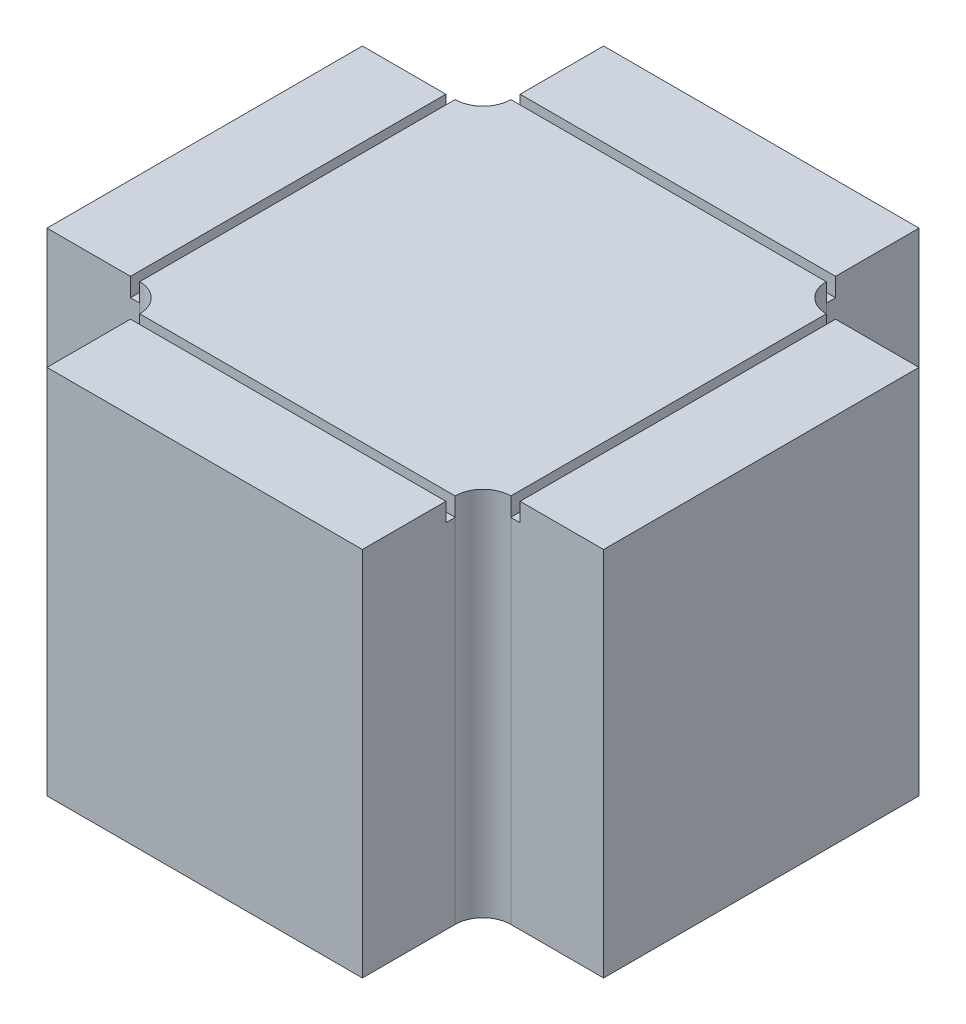
ISO-10303-21;
HEADER;
FILE_DESCRIPTION(('STEP AP214'),'2;1');
FILE_NAME('part.step','',(''),(''),'','','');
FILE_SCHEMA(('AUTOMOTIVE_DESIGN { 1 0 10303 214 1 1 1 1 }'));
ENDSEC;
DATA;
#1=APPLICATION_CONTEXT('core data for automotive mechanical design processes');
#2=APPLICATION_PROTOCOL_DEFINITION('international standard','automotive_design',2000,#1);
#3=PRODUCT_CONTEXT('',#1,'mechanical');
#4=PRODUCT('Part','Part','',(#3));
#5=PRODUCT_RELATED_PRODUCT_CATEGORY('part','',(#4));
#6=PRODUCT_DEFINITION_FORMATION('','',#4);
#7=PRODUCT_DEFINITION_CONTEXT('part definition',#1,'design');
#8=PRODUCT_DEFINITION('design','',#6,#7);
#9=PRODUCT_DEFINITION_SHAPE('','',#8);
#10=(LENGTH_UNIT() NAMED_UNIT(*) SI_UNIT(.MILLI.,.METRE.));
#11=(NAMED_UNIT(*) PLANE_ANGLE_UNIT() SI_UNIT($,.RADIAN.));
#12=(NAMED_UNIT(*) SI_UNIT($,.STERADIAN.) SOLID_ANGLE_UNIT());
#13=UNCERTAINTY_MEASURE_WITH_UNIT(LENGTH_MEASURE(1.E-05),#10,'distance_accuracy_value','');
#14=(GEOMETRIC_REPRESENTATION_CONTEXT(3) GLOBAL_UNCERTAINTY_ASSIGNED_CONTEXT((#13)) GLOBAL_UNIT_ASSIGNED_CONTEXT((#10,
#11,#12)) REPRESENTATION_CONTEXT('',''));
#15=CARTESIAN_POINT('',(0.,0.,0.));
#16=DIRECTION('',(0.,0.,1.));
#17=DIRECTION('',(1.,0.,0.));
#18=AXIS2_PLACEMENT_3D('',#15,#16,#17);
#19=CARTESIAN_POINT('',(16.9999999999999,40.,0.));
#20=DIRECTION('',(-1.,0.,0.));
#21=DIRECTION('',(0.,0.,1.));
#22=AXIS2_PLACEMENT_3D('',#19,#20,#21);
#23=PLANE('',#22);
#24=DIRECTION('',(0.,1.,0.));
#25=VECTOR('',#24,1.);
#26=CARTESIAN_POINT('',(16.9999999999999,40.,-21.));
#27=LINE('',#26,#25);
#28=CARTESIAN_POINT('',(16.9999999999999,38.,-21.));
#29=VERTEX_POINT('',#28);
#30=CARTESIAN_POINT('',(16.9999999999999,40.,-21.));
#31=VERTEX_POINT('',#30);
#32=EDGE_CURVE('E470',#29,#31,#27,.T.);
#33=ORIENTED_EDGE('',*,*,#32,.F.);
#34=DIRECTION('',(0.,0.,-1.));
#35=VECTOR('',#34,1.);
#36=CARTESIAN_POINT('',(16.9999999999999,38.,0.));
#37=LINE('',#36,#35);
#38=CARTESIAN_POINT('',(16.9999999999999,38.,-20.));
#39=VERTEX_POINT('',#38);
#40=EDGE_CURVE('E352',#39,#29,#37,.T.);
#41=ORIENTED_EDGE('',*,*,#40,.F.);
#42=DIRECTION('',(0.,-1.,0.));
#43=VECTOR('',#42,1.);
#44=CARTESIAN_POINT('',(16.9999999999999,40.,-20.));
#45=LINE('',#44,#43);
#46=CARTESIAN_POINT('',(16.9999999999999,0.,-20.));
#47=VERTEX_POINT('',#46);
#48=EDGE_CURVE('E282',#39,#47,#45,.T.);
#49=ORIENTED_EDGE('',*,*,#48,.T.);
#50=DIRECTION('',(0.,0.,-1.));
#51=VECTOR('',#50,1.);
#52=CARTESIAN_POINT('',(16.9999999999999,0.,0.));
#53=LINE('',#52,#51);
#54=CARTESIAN_POINT('',(16.9999999999999,0.,-30.));
#55=VERTEX_POINT('',#54);
#56=EDGE_CURVE('E226',#47,#55,#53,.T.);
#57=ORIENTED_EDGE('',*,*,#56,.T.);
#58=DIRECTION('',(0.,-1.,0.));
#59=VECTOR('',#58,1.);
#60=CARTESIAN_POINT('',(16.9999999999999,40.,-30.));
#61=LINE('',#60,#59);
#62=CARTESIAN_POINT('',(16.9999999999999,40.,-30.));
#63=VERTEX_POINT('',#62);
#64=EDGE_CURVE('E279',#63,#55,#61,.T.);
#65=ORIENTED_EDGE('',*,*,#64,.F.);
#66=DIRECTION('',(0.,0.,-1.));
#67=VECTOR('',#66,1.);
#68=CARTESIAN_POINT('',(16.9999999999999,40.,0.));
#69=LINE('',#68,#67);
#70=EDGE_CURVE('E370',#31,#63,#69,.T.);
#71=ORIENTED_EDGE('',*,*,#70,.F.);
#72=EDGE_LOOP('',(#33,#41,#49,#57,#65,#71));
#73=FACE_BOUND('',#72,.T.);
#74=ADVANCED_FACE('F66',(#73),#23,.F.);
#75=CARTESIAN_POINT('',(-17.0000000000001,40.,0.));
#76=DIRECTION('',(-1.,0.,0.));
#77=DIRECTION('',(0.,0.,1.));
#78=AXIS2_PLACEMENT_3D('',#75,#76,#77);
#79=PLANE('',#78);
#80=DIRECTION('',(0.,0.,-1.));
#81=VECTOR('',#80,1.);
#82=CARTESIAN_POINT('',(-17.0000000000001,38.,0.));
#83=LINE('',#82,#81);
#84=CARTESIAN_POINT('',(-17.,38.,-20.));
#85=VERTEX_POINT('',#84);
#86=CARTESIAN_POINT('',(-17.0000000000001,38.,-21.));
#87=VERTEX_POINT('',#86);
#88=EDGE_CURVE('E349',#85,#87,#83,.T.);
#89=ORIENTED_EDGE('',*,*,#88,.T.);
#90=DIRECTION('',(0.,1.,0.));
#91=VECTOR('',#90,1.);
#92=CARTESIAN_POINT('',(-17.0000000000001,40.,-21.));
#93=LINE('',#92,#91);
#94=CARTESIAN_POINT('',(-17.0000000000001,40.,-21.));
#95=VERTEX_POINT('',#94);
#96=EDGE_CURVE('E467',#87,#95,#93,.T.);
#97=ORIENTED_EDGE('',*,*,#96,.T.);
#98=DIRECTION('',(0.,0.,-1.));
#99=VECTOR('',#98,1.);
#100=CARTESIAN_POINT('',(-17.0000000000001,40.,0.));
#101=LINE('',#100,#99);
#102=CARTESIAN_POINT('',(-17.0000000000001,40.,-30.));
#103=VERTEX_POINT('',#102);
#104=EDGE_CURVE('E375',#95,#103,#101,.T.);
#105=ORIENTED_EDGE('',*,*,#104,.T.);
#106=DIRECTION('',(0.,-1.,0.));
#107=VECTOR('',#106,1.);
#108=CARTESIAN_POINT('',(-17.0000000000001,40.,-30.));
#109=LINE('',#108,#107);
#110=CARTESIAN_POINT('',(-17.0000000000001,0.,-30.));
#111=VERTEX_POINT('',#110);
#112=EDGE_CURVE('E277',#103,#111,#109,.T.);
#113=ORIENTED_EDGE('',*,*,#112,.T.);
#114=DIRECTION('',(0.,0.,-1.));
#115=VECTOR('',#114,1.);
#116=CARTESIAN_POINT('',(-17.0000000000001,0.,0.));
#117=LINE('',#116,#115);
#118=CARTESIAN_POINT('',(-17.0000000000001,0.,-20.));
#119=VERTEX_POINT('',#118);
#120=EDGE_CURVE('E231',#119,#111,#117,.T.);
#121=ORIENTED_EDGE('',*,*,#120,.F.);
#122=DIRECTION('',(0.,-1.,0.));
#123=VECTOR('',#122,1.);
#124=CARTESIAN_POINT('',(-17.0000000000001,40.,-20.));
#125=LINE('',#124,#123);
#126=EDGE_CURVE('E273',#85,#119,#125,.T.);
#127=ORIENTED_EDGE('',*,*,#126,.F.);
#128=EDGE_LOOP('',(#89,#97,#105,#113,#121,#127));
#129=FACE_BOUND('',#128,.T.);
#130=ADVANCED_FACE('F553',(#129),#79,.T.);
#131=CARTESIAN_POINT('',(0.,40.,-17.));
#132=DIRECTION('',(0.,0.,1.));
#133=DIRECTION('',(1.,0.,0.));
#134=AXIS2_PLACEMENT_3D('',#131,#132,#133);
#135=PLANE('',#134);
#136=DIRECTION('',(0.,1.,0.));
#137=VECTOR('',#136,1.);
#138=CARTESIAN_POINT('',(-21.,40.,-17.));
#139=LINE('',#138,#137);
#140=CARTESIAN_POINT('',(-21.,38.,-17.));
#141=VERTEX_POINT('',#140);
#142=CARTESIAN_POINT('',(-21.,40.,-17.));
#143=VERTEX_POINT('',#142);
#144=EDGE_CURVE('E332',#141,#143,#139,.T.);
#145=ORIENTED_EDGE('',*,*,#144,.F.);
#146=DIRECTION('',(-1.,0.,0.));
#147=VECTOR('',#146,1.);
#148=CARTESIAN_POINT('',(0.,38.,-17.));
#149=LINE('',#148,#147);
#150=CARTESIAN_POINT('',(-20.,38.,-17.));
#151=VERTEX_POINT('',#150);
#152=EDGE_CURVE('E346',#151,#141,#149,.T.);
#153=ORIENTED_EDGE('',*,*,#152,.F.);
#154=DIRECTION('',(0.,-1.,0.));
#155=VECTOR('',#154,1.);
#156=CARTESIAN_POINT('',(-20.,40.,-17.));
#157=LINE('',#156,#155);
#158=CARTESIAN_POINT('',(-20.,0.,-17.));
#159=VERTEX_POINT('',#158);
#160=EDGE_CURVE('E269',#151,#159,#157,.T.);
#161=ORIENTED_EDGE('',*,*,#160,.T.);
#162=DIRECTION('',(-1.,0.,0.));
#163=VECTOR('',#162,1.);
#164=CARTESIAN_POINT('',(0.,0.,-17.));
#165=LINE('',#164,#163);
#166=CARTESIAN_POINT('',(-30.,0.,-17.));
#167=VERTEX_POINT('',#166);
#168=EDGE_CURVE('E237',#159,#167,#165,.T.);
#169=ORIENTED_EDGE('',*,*,#168,.T.);
#170=DIRECTION('',(0.,-1.,0.));
#171=VECTOR('',#170,1.);
#172=CARTESIAN_POINT('',(-30.,40.,-17.));
#173=LINE('',#172,#171);
#174=CARTESIAN_POINT('',(-30.,40.,-17.));
#175=VERTEX_POINT('',#174);
#176=EDGE_CURVE('E266',#175,#167,#173,.T.);
#177=ORIENTED_EDGE('',*,*,#176,.F.);
#178=DIRECTION('',(-1.,0.,0.));
#179=VECTOR('',#178,1.);
#180=CARTESIAN_POINT('',(0.,40.,-17.));
#181=LINE('',#180,#179);
#182=EDGE_CURVE('E380',#143,#175,#181,.T.);
#183=ORIENTED_EDGE('',*,*,#182,.F.);
#184=EDGE_LOOP('',(#145,#153,#161,#169,#177,#183));
#185=FACE_BOUND('',#184,.T.);
#186=ADVANCED_FACE('F575',(#185),#135,.F.);
#187=CARTESIAN_POINT('',(0.,40.,17.));
#188=DIRECTION('',(0.,0.,1.));
#189=DIRECTION('',(1.,0.,0.));
#190=AXIS2_PLACEMENT_3D('',#187,#188,#189);
#191=PLANE('',#190);
#192=DIRECTION('',(-1.,0.,0.));
#193=VECTOR('',#192,1.);
#194=CARTESIAN_POINT('',(0.,38.,17.));
#195=LINE('',#194,#193);
#196=CARTESIAN_POINT('',(-20.,38.,17.));
#197=VERTEX_POINT('',#196);
#198=CARTESIAN_POINT('',(-21.,38.,17.));
#199=VERTEX_POINT('',#198);
#200=EDGE_CURVE('E343',#197,#199,#195,.T.);
#201=ORIENTED_EDGE('',*,*,#200,.T.);
#202=DIRECTION('',(0.,1.,0.));
#203=VECTOR('',#202,1.);
#204=CARTESIAN_POINT('',(-21.,40.,17.));
#205=LINE('',#204,#203);
#206=CARTESIAN_POINT('',(-21.,40.,17.));
#207=VERTEX_POINT('',#206);
#208=EDGE_CURVE('E337',#199,#207,#205,.T.);
#209=ORIENTED_EDGE('',*,*,#208,.T.);
#210=DIRECTION('',(-1.,0.,0.));
#211=VECTOR('',#210,1.);
#212=CARTESIAN_POINT('',(0.,40.,17.));
#213=LINE('',#212,#211);
#214=CARTESIAN_POINT('',(-30.,40.,17.));
#215=VERTEX_POINT('',#214);
#216=EDGE_CURVE('E385',#207,#215,#213,.T.);
#217=ORIENTED_EDGE('',*,*,#216,.T.);
#218=DIRECTION('',(0.,-1.,0.));
#219=VECTOR('',#218,1.);
#220=CARTESIAN_POINT('',(-30.,40.,17.));
#221=LINE('',#220,#219);
#222=CARTESIAN_POINT('',(-30.,0.,17.));
#223=VERTEX_POINT('',#222);
#224=EDGE_CURVE('E264',#215,#223,#221,.T.);
#225=ORIENTED_EDGE('',*,*,#224,.T.);
#226=DIRECTION('',(-1.,0.,0.));
#227=VECTOR('',#226,1.);
#228=CARTESIAN_POINT('',(0.,0.,17.));
#229=LINE('',#228,#227);
#230=CARTESIAN_POINT('',(-20.,0.,17.));
#231=VERTEX_POINT('',#230);
#232=EDGE_CURVE('E242',#231,#223,#229,.T.);
#233=ORIENTED_EDGE('',*,*,#232,.F.);
#234=DIRECTION('',(0.,-1.,0.));
#235=VECTOR('',#234,1.);
#236=CARTESIAN_POINT('',(-20.,40.,17.));
#237=LINE('',#236,#235);
#238=EDGE_CURVE('E260',#197,#231,#237,.T.);
#239=ORIENTED_EDGE('',*,*,#238,.F.);
#240=EDGE_LOOP('',(#201,#209,#217,#225,#233,#239));
#241=FACE_BOUND('',#240,.T.);
#242=ADVANCED_FACE('F474',(#241),#191,.T.);
#243=CARTESIAN_POINT('',(0.,40.,0.));
#244=DIRECTION('',(0.,1.,0.));
#245=DIRECTION('',(0.,0.,1.));
#246=AXIS2_PLACEMENT_3D('',#243,#244,#245);
#247=PLANE('',#246);
#248=ORIENTED_EDGE('',*,*,#216,.F.);
#249=DIRECTION('',(0.,0.,-1.));
#250=VECTOR('',#249,1.);
#251=CARTESIAN_POINT('',(-21.,40.,0.));
#252=LINE('',#251,#250);
#253=EDGE_CURVE('E316',#207,#143,#252,.T.);
#254=ORIENTED_EDGE('',*,*,#253,.T.);
#255=ORIENTED_EDGE('',*,*,#182,.T.);
#256=DIRECTION('',(0.,0.,1.));
#257=VECTOR('',#256,1.);
#258=CARTESIAN_POINT('',(-30.,40.,0.));
#259=LINE('',#258,#257);
#260=EDGE_CURVE('E382',#175,#215,#259,.T.);
#261=ORIENTED_EDGE('',*,*,#260,.T.);
#262=EDGE_LOOP('',(#248,#254,#255,#261));
#263=FACE_BOUND('',#262,.T.);
#264=ADVANCED_FACE('F480',(#263),#247,.T.);
#265=ORIENTED_EDGE('',*,*,#104,.F.);
#266=DIRECTION('',(1.,0.,0.));
#267=VECTOR('',#266,1.);
#268=CARTESIAN_POINT('',(0.,40.,-21.));
#269=LINE('',#268,#267);
#270=EDGE_CURVE('E313',#95,#31,#269,.T.);
#271=ORIENTED_EDGE('',*,*,#270,.T.);
#272=ORIENTED_EDGE('',*,*,#70,.T.);
#273=DIRECTION('',(-1.,0.,0.));
#274=VECTOR('',#273,1.);
#275=CARTESIAN_POINT('',(0.,40.,-30.));
#276=LINE('',#275,#274);
#277=EDGE_CURVE('E372',#63,#103,#276,.T.);
#278=ORIENTED_EDGE('',*,*,#277,.T.);
#279=EDGE_LOOP('',(#265,#271,#272,#278));
#280=FACE_BOUND('',#279,.T.);
#281=ADVANCED_FACE('F548',(#280),#247,.T.);
#282=CARTESIAN_POINT('',(-20.,40.,20.));
#283=DIRECTION('',(0.,1.,0.));
#284=DIRECTION('',(0.,0.,1.));
#285=AXIS2_PLACEMENT_3D('',#282,#283,#284);
#286=CIRCLE('',#285,3.);
#287=CARTESIAN_POINT('',(-17.,40.,20.));
#288=VERTEX_POINT('',#287);
#289=CARTESIAN_POINT('',(-20.,40.,17.));
#290=VERTEX_POINT('',#289);
#291=EDGE_CURVE('E195',#288,#290,#286,.T.);
#292=ORIENTED_EDGE('',*,*,#291,.F.);
#293=DIRECTION('',(1.,0.,0.));
#294=VECTOR('',#293,1.);
#295=CARTESIAN_POINT('',(0.,40.,20.));
#296=LINE('',#295,#294);
#297=CARTESIAN_POINT('',(17.,40.,19.9999999999999));
#298=VERTEX_POINT('',#297);
#299=EDGE_CURVE('E308',#288,#298,#296,.T.);
#300=ORIENTED_EDGE('',*,*,#299,.T.);
#301=CARTESIAN_POINT('',(20.,40.,20.));
#302=DIRECTION('',(0.,1.,0.));
#303=DIRECTION('',(0.,0.,1.));
#304=AXIS2_PLACEMENT_3D('',#301,#302,#303);
#305=CIRCLE('',#304,3.);
#306=CARTESIAN_POINT('',(20.,40.,16.9999999999999));
#307=VERTEX_POINT('',#306);
#308=EDGE_CURVE('E254',#307,#298,#305,.T.);
#309=ORIENTED_EDGE('',*,*,#308,.F.);
#310=DIRECTION('',(0.,0.,-1.));
#311=VECTOR('',#310,1.);
#312=CARTESIAN_POINT('',(20.,40.,0.));
#313=LINE('',#312,#311);
#314=CARTESIAN_POINT('',(19.9999999999999,40.,-17.0000000000001));
#315=VERTEX_POINT('',#314);
#316=EDGE_CURVE('E299',#307,#315,#313,.T.);
#317=ORIENTED_EDGE('',*,*,#316,.T.);
#318=CARTESIAN_POINT('',(20.,40.,-20.));
#319=DIRECTION('',(0.,1.,0.));
#320=DIRECTION('',(0.,0.,1.));
#321=AXIS2_PLACEMENT_3D('',#318,#319,#320);
#322=CIRCLE('',#321,3.);
#323=CARTESIAN_POINT('',(16.9999999999999,40.,-20.));
#324=VERTEX_POINT('',#323);
#325=EDGE_CURVE('E367',#324,#315,#322,.T.);
#326=ORIENTED_EDGE('',*,*,#325,.F.);
#327=DIRECTION('',(1.,0.,0.));
#328=VECTOR('',#327,1.);
#329=CARTESIAN_POINT('',(0.,40.,-20.));
#330=LINE('',#329,#328);
#331=CARTESIAN_POINT('',(-17.0000000000001,40.,-20.));
#332=VERTEX_POINT('',#331);
#333=EDGE_CURVE('E302',#332,#324,#330,.T.);
#334=ORIENTED_EDGE('',*,*,#333,.F.);
#335=CARTESIAN_POINT('',(-20.,40.,-20.));
#336=DIRECTION('',(0.,1.,0.));
#337=DIRECTION('',(0.,0.,1.));
#338=AXIS2_PLACEMENT_3D('',#335,#336,#337);
#339=CIRCLE('',#338,3.);
#340=CARTESIAN_POINT('',(-20.,40.,-17.));
#341=VERTEX_POINT('',#340);
#342=EDGE_CURVE('E377',#341,#332,#339,.T.);
#343=ORIENTED_EDGE('',*,*,#342,.F.);
#344=DIRECTION('',(0.,0.,-1.));
#345=VECTOR('',#344,1.);
#346=CARTESIAN_POINT('',(-20.,40.,0.));
#347=LINE('',#346,#345);
#348=EDGE_CURVE('E305',#290,#341,#347,.T.);
#349=ORIENTED_EDGE('',*,*,#348,.F.);
#350=EDGE_LOOP('',(#292,#300,#309,#317,#326,#334,#343,#349));
#351=FACE_BOUND('',#350,.T.);
#352=ADVANCED_FACE('F397',(#351),#247,.T.);
#353=DIRECTION('',(1.,0.,0.));
#354=VECTOR('',#353,1.);
#355=CARTESIAN_POINT('',(0.,40.,21.));
#356=LINE('',#355,#354);
#357=CARTESIAN_POINT('',(-17.,40.,21.));
#358=VERTEX_POINT('',#357);
#359=CARTESIAN_POINT('',(17.,40.,21.));
#360=VERTEX_POINT('',#359);
#361=EDGE_CURVE('E75',#358,#360,#356,.T.);
#362=ORIENTED_EDGE('',*,*,#361,.F.);
#363=DIRECTION('',(0.,0.,1.));
#364=VECTOR('',#363,1.);
#365=CARTESIAN_POINT('',(-17.,40.,0.));
#366=LINE('',#365,#364);
#367=CARTESIAN_POINT('',(-17.,40.,29.9999999999999));
#368=VERTEX_POINT('',#367);
#369=EDGE_CURVE('E185',#358,#368,#366,.T.);
#370=ORIENTED_EDGE('',*,*,#369,.T.);
#371=DIRECTION('',(1.,0.,0.));
#372=VECTOR('',#371,1.);
#373=CARTESIAN_POINT('',(0.,40.,29.9999999999999));
#374=LINE('',#373,#372);
#375=CARTESIAN_POINT('',(17.,40.,29.9999999999999));
#376=VERTEX_POINT('',#375);
#377=EDGE_CURVE('E190',#368,#376,#374,.T.);
#378=ORIENTED_EDGE('',*,*,#377,.T.);
#379=DIRECTION('',(0.,0.,1.));
#380=VECTOR('',#379,1.);
#381=CARTESIAN_POINT('',(17.,40.,0.));
#382=LINE('',#381,#380);
#383=EDGE_CURVE('E207',#360,#376,#382,.T.);
#384=ORIENTED_EDGE('',*,*,#383,.F.);
#385=EDGE_LOOP('',(#362,#370,#378,#384));
#386=FACE_BOUND('',#385,.T.);
#387=ADVANCED_FACE('F187',(#386),#247,.T.);
#388=CARTESIAN_POINT('',(20.,40.,20.));
#389=DIRECTION('',(0.,-1.,0.));
#390=DIRECTION('',(0.,0.,-1.));
#391=AXIS2_PLACEMENT_3D('',#388,#389,#390);
#392=CYLINDRICAL_SURFACE('',#391,3.);
#393=CARTESIAN_POINT('',(20.,0.,20.));
#394=DIRECTION('',(0.,1.,0.));
#395=DIRECTION('',(0.,0.,1.));
#396=AXIS2_PLACEMENT_3D('',#393,#394,#395);
#397=CIRCLE('',#396,3.);
#398=CARTESIAN_POINT('',(19.9999999999999,0.,16.9999999999999));
#399=VERTEX_POINT('',#398);
#400=CARTESIAN_POINT('',(17.,0.,19.9999999999999));
#401=VERTEX_POINT('',#400);
#402=EDGE_CURVE('E212',#399,#401,#397,.T.);
#403=ORIENTED_EDGE('',*,*,#402,.F.);
#404=DIRECTION('',(0.,-1.,0.));
#405=VECTOR('',#404,1.);
#406=CARTESIAN_POINT('',(19.9999999999999,40.,16.9999999999999));
#407=LINE('',#406,#405);
#408=CARTESIAN_POINT('',(20.,38.,16.9999999999999));
#409=VERTEX_POINT('',#408);
#410=EDGE_CURVE('E295',#409,#399,#407,.T.);
#411=ORIENTED_EDGE('',*,*,#410,.F.);
#412=EDGE_CURVE('E296',#307,#409,#407,.T.);
#413=ORIENTED_EDGE('',*,*,#412,.F.);
#414=ORIENTED_EDGE('',*,*,#308,.T.);
#415=DIRECTION('',(0.,-1.,0.));
#416=VECTOR('',#415,1.);
#417=CARTESIAN_POINT('',(17.,40.,19.9999999999999));
#418=LINE('',#417,#416);
#419=CARTESIAN_POINT('',(17.,38.,20.));
#420=VERTEX_POINT('',#419);
#421=EDGE_CURVE('E83',#298,#420,#418,.T.);
#422=ORIENTED_EDGE('',*,*,#421,.T.);
#423=EDGE_CURVE('E144',#420,#401,#418,.T.);
#424=ORIENTED_EDGE('',*,*,#423,.T.);
#425=EDGE_LOOP('',(#403,#411,#413,#414,#422,#424));
#426=FACE_BOUND('',#425,.T.);
#427=ADVANCED_FACE('F68',(#426),#392,.F.);
#428=CARTESIAN_POINT('',(0.,40.,16.9999999999999));
#429=DIRECTION('',(0.,0.,-1.));
#430=DIRECTION('',(-1.,0.,0.));
#431=AXIS2_PLACEMENT_3D('',#428,#429,#430);
#432=PLANE('',#431);
#433=DIRECTION('',(1.,0.,0.));
#434=VECTOR('',#433,1.);
#435=CARTESIAN_POINT('',(0.,40.,16.9999999999999));
#436=LINE('',#435,#434);
#437=CARTESIAN_POINT('',(21.,40.,16.9999999999999));
#438=VERTEX_POINT('',#437);
#439=CARTESIAN_POINT('',(29.9999999999999,40.,16.9999999999999));
#440=VERTEX_POINT('',#439);
#441=EDGE_CURVE('E153',#438,#440,#436,.T.);
#442=ORIENTED_EDGE('',*,*,#441,.F.);
#443=DIRECTION('',(0.,-1.,0.));
#444=VECTOR('',#443,1.);
#445=CARTESIAN_POINT('',(21.,40.,16.9999999999999));
#446=LINE('',#445,#444);
#447=CARTESIAN_POINT('',(21.,38.,16.9999999999999));
#448=VERTEX_POINT('',#447);
#449=EDGE_CURVE('E464',#438,#448,#446,.T.);
#450=ORIENTED_EDGE('',*,*,#449,.T.);
#451=DIRECTION('',(1.,0.,0.));
#452=VECTOR('',#451,1.);
#453=CARTESIAN_POINT('',(0.,38.,16.9999999999999));
#454=LINE('',#453,#452);
#455=EDGE_CURVE('E215',#409,#448,#454,.T.);
#456=ORIENTED_EDGE('',*,*,#455,.F.);
#457=ORIENTED_EDGE('',*,*,#410,.T.);
#458=DIRECTION('',(1.,0.,0.));
#459=VECTOR('',#458,1.);
#460=CARTESIAN_POINT('',(0.,0.,16.9999999999999));
#461=LINE('',#460,#459);
#462=CARTESIAN_POINT('',(29.9999999999999,0.,16.9999999999999));
#463=VERTEX_POINT('',#462);
#464=EDGE_CURVE('E214',#399,#463,#461,.T.);
#465=ORIENTED_EDGE('',*,*,#464,.T.);
#466=DIRECTION('',(0.,-1.,0.));
#467=VECTOR('',#466,1.);
#468=CARTESIAN_POINT('',(29.9999999999999,40.,16.9999999999999));
#469=LINE('',#468,#467);
#470=EDGE_CURVE('E292',#440,#463,#469,.T.);
#471=ORIENTED_EDGE('',*,*,#470,.F.);
#472=EDGE_LOOP('',(#442,#450,#456,#457,#465,#471));
#473=FACE_BOUND('',#472,.T.);
#474=ADVANCED_FACE('F587',(#473),#432,.F.);
#475=CARTESIAN_POINT('',(29.9999999999999,40.,0.));
#476=DIRECTION('',(-1.,0.,0.));
#477=DIRECTION('',(0.,0.,1.));
#478=AXIS2_PLACEMENT_3D('',#475,#476,#477);
#479=PLANE('',#478);
#480=DIRECTION('',(0.,0.,-1.));
#481=VECTOR('',#480,1.);
#482=CARTESIAN_POINT('',(29.9999999999999,0.,0.));
#483=LINE('',#482,#481);
#484=CARTESIAN_POINT('',(29.9999999999999,0.,-17.0000000000001));
#485=VERTEX_POINT('',#484);
#486=EDGE_CURVE('E217',#463,#485,#483,.T.);
#487=ORIENTED_EDGE('',*,*,#486,.T.);
#488=DIRECTION('',(0.,-1.,0.));
#489=VECTOR('',#488,1.);
#490=CARTESIAN_POINT('',(29.9999999999999,40.,-17.0000000000001));
#491=LINE('',#490,#489);
#492=CARTESIAN_POINT('',(29.9999999999999,40.,-17.0000000000001));
#493=VERTEX_POINT('',#492);
#494=EDGE_CURVE('E290',#493,#485,#491,.T.);
#495=ORIENTED_EDGE('',*,*,#494,.F.);
#496=DIRECTION('',(0.,0.,-1.));
#497=VECTOR('',#496,1.);
#498=CARTESIAN_POINT('',(29.9999999999999,40.,0.));
#499=LINE('',#498,#497);
#500=EDGE_CURVE('E363',#440,#493,#499,.T.);
#501=ORIENTED_EDGE('',*,*,#500,.F.);
#502=ORIENTED_EDGE('',*,*,#470,.T.);
#503=EDGE_LOOP('',(#487,#495,#501,#502));
#504=FACE_BOUND('',#503,.T.);
#505=ADVANCED_FACE('F584',(#504),#479,.F.);
#506=CARTESIAN_POINT('',(0.,40.,-17.0000000000001));
#507=DIRECTION('',(0.,0.,-1.));
#508=DIRECTION('',(-1.,0.,0.));
#509=AXIS2_PLACEMENT_3D('',#506,#507,#508);
#510=PLANE('',#509);
#511=DIRECTION('',(0.,-1.,0.));
#512=VECTOR('',#511,1.);
#513=CARTESIAN_POINT('',(21.,40.,-17.0000000000001));
#514=LINE('',#513,#512);
#515=CARTESIAN_POINT('',(21.,40.,-17.0000000000001));
#516=VERTEX_POINT('',#515);
#517=CARTESIAN_POINT('',(21.,38.,-17.0000000000001));
#518=VERTEX_POINT('',#517);
#519=EDGE_CURVE('E462',#516,#518,#514,.T.);
#520=ORIENTED_EDGE('',*,*,#519,.F.);
#521=DIRECTION('',(1.,0.,0.));
#522=VECTOR('',#521,1.);
#523=CARTESIAN_POINT('',(0.,40.,-17.0000000000001));
#524=LINE('',#523,#522);
#525=EDGE_CURVE('E365',#516,#493,#524,.T.);
#526=ORIENTED_EDGE('',*,*,#525,.T.);
#527=ORIENTED_EDGE('',*,*,#494,.T.);
#528=DIRECTION('',(1.,0.,0.));
#529=VECTOR('',#528,1.);
#530=CARTESIAN_POINT('',(0.,0.,-17.0000000000001));
#531=LINE('',#530,#529);
#532=CARTESIAN_POINT('',(19.9999999999999,0.,-17.0000000000001));
#533=VERTEX_POINT('',#532);
#534=EDGE_CURVE('E220',#533,#485,#531,.T.);
#535=ORIENTED_EDGE('',*,*,#534,.F.);
#536=DIRECTION('',(0.,-1.,0.));
#537=VECTOR('',#536,1.);
#538=CARTESIAN_POINT('',(19.9999999999999,40.,-17.0000000000001));
#539=LINE('',#538,#537);
#540=CARTESIAN_POINT('',(20.,38.,-17.));
#541=VERTEX_POINT('',#540);
#542=EDGE_CURVE('E286',#541,#533,#539,.T.);
#543=ORIENTED_EDGE('',*,*,#542,.F.);
#544=DIRECTION('',(1.,0.,0.));
#545=VECTOR('',#544,1.);
#546=CARTESIAN_POINT('',(0.,38.,-17.0000000000001));
#547=LINE('',#546,#545);
#548=EDGE_CURVE('E355',#541,#518,#547,.T.);
#549=ORIENTED_EDGE('',*,*,#548,.T.);
#550=EDGE_LOOP('',(#520,#526,#527,#535,#543,#549));
#551=FACE_BOUND('',#550,.T.);
#552=ADVANCED_FACE('F581',(#551),#510,.T.);
#553=CARTESIAN_POINT('',(20.,40.,-20.));
#554=DIRECTION('',(0.,-1.,0.));
#555=DIRECTION('',(0.,0.,-1.));
#556=AXIS2_PLACEMENT_3D('',#553,#554,#555);
#557=CYLINDRICAL_SURFACE('',#556,3.);
#558=CARTESIAN_POINT('',(20.,0.,-20.));
#559=DIRECTION('',(0.,1.,0.));
#560=DIRECTION('',(0.,0.,1.));
#561=AXIS2_PLACEMENT_3D('',#558,#559,#560);
#562=CIRCLE('',#561,3.);
#563=EDGE_CURVE('E223',#47,#533,#562,.T.);
#564=ORIENTED_EDGE('',*,*,#563,.F.);
#565=ORIENTED_EDGE('',*,*,#48,.F.);
#566=EDGE_CURVE('E283',#324,#39,#45,.T.);
#567=ORIENTED_EDGE('',*,*,#566,.F.);
#568=ORIENTED_EDGE('',*,*,#325,.T.);
#569=EDGE_CURVE('E287',#315,#541,#539,.T.);
#570=ORIENTED_EDGE('',*,*,#569,.T.);
#571=ORIENTED_EDGE('',*,*,#542,.T.);
#572=EDGE_LOOP('',(#564,#565,#567,#568,#570,#571));
#573=FACE_BOUND('',#572,.T.);
#574=ADVANCED_FACE('F533',(#573),#557,.F.);
#575=CARTESIAN_POINT('',(0.,40.,-30.));
#576=DIRECTION('',(0.,0.,1.));
#577=DIRECTION('',(1.,0.,0.));
#578=AXIS2_PLACEMENT_3D('',#575,#576,#577);
#579=PLANE('',#578);
#580=DIRECTION('',(-1.,0.,0.));
#581=VECTOR('',#580,1.);
#582=CARTESIAN_POINT('',(0.,0.,-30.));
#583=LINE('',#582,#581);
#584=EDGE_CURVE('E228',#55,#111,#583,.T.);
#585=ORIENTED_EDGE('',*,*,#584,.T.);
#586=ORIENTED_EDGE('',*,*,#112,.F.);
#587=ORIENTED_EDGE('',*,*,#277,.F.);
#588=ORIENTED_EDGE('',*,*,#64,.T.);
#589=EDGE_LOOP('',(#585,#586,#587,#588));
#590=FACE_BOUND('',#589,.T.);
#591=ADVANCED_FACE('F543',(#590),#579,.F.);
#592=CARTESIAN_POINT('',(-20.,40.,-20.));
#593=DIRECTION('',(0.,-1.,0.));
#594=DIRECTION('',(0.,0.,-1.));
#595=AXIS2_PLACEMENT_3D('',#592,#593,#594);
#596=CYLINDRICAL_SURFACE('',#595,3.);
#597=CARTESIAN_POINT('',(-20.,0.,-20.));
#598=DIRECTION('',(0.,1.,0.));
#599=DIRECTION('',(0.,0.,1.));
#600=AXIS2_PLACEMENT_3D('',#597,#598,#599);
#601=CIRCLE('',#600,3.);
#602=EDGE_CURVE('E234',#159,#119,#601,.T.);
#603=ORIENTED_EDGE('',*,*,#602,.F.);
#604=ORIENTED_EDGE('',*,*,#160,.F.);
#605=EDGE_CURVE('E270',#341,#151,#157,.T.);
#606=ORIENTED_EDGE('',*,*,#605,.F.);
#607=ORIENTED_EDGE('',*,*,#342,.T.);
#608=EDGE_CURVE('E274',#332,#85,#125,.T.);
#609=ORIENTED_EDGE('',*,*,#608,.T.);
#610=ORIENTED_EDGE('',*,*,#126,.T.);
#611=EDGE_LOOP('',(#603,#604,#606,#607,#609,#610));
#612=FACE_BOUND('',#611,.T.);
#613=ADVANCED_FACE('F523',(#612),#596,.F.);
#614=CARTESIAN_POINT('',(-30.,40.,0.));
#615=DIRECTION('',(1.,0.,0.));
#616=DIRECTION('',(0.,0.,-1.));
#617=AXIS2_PLACEMENT_3D('',#614,#615,#616);
#618=PLANE('',#617);
#619=DIRECTION('',(0.,0.,1.));
#620=VECTOR('',#619,1.);
#621=CARTESIAN_POINT('',(-30.,0.,0.));
#622=LINE('',#621,#620);
#623=EDGE_CURVE('E239',#167,#223,#622,.T.);
#624=ORIENTED_EDGE('',*,*,#623,.T.);
#625=ORIENTED_EDGE('',*,*,#224,.F.);
#626=ORIENTED_EDGE('',*,*,#260,.F.);
#627=ORIENTED_EDGE('',*,*,#176,.T.);
#628=EDGE_LOOP('',(#624,#625,#626,#627));
#629=FACE_BOUND('',#628,.T.);
#630=ADVANCED_FACE('F486',(#629),#618,.F.);
#631=CARTESIAN_POINT('',(-20.,40.,20.));
#632=DIRECTION('',(0.,-1.,0.));
#633=DIRECTION('',(0.,0.,-1.));
#634=AXIS2_PLACEMENT_3D('',#631,#632,#633);
#635=CYLINDRICAL_SURFACE('',#634,3.);
#636=CARTESIAN_POINT('',(-20.,0.,20.));
#637=DIRECTION('',(0.,1.,0.));
#638=DIRECTION('',(0.,0.,1.));
#639=AXIS2_PLACEMENT_3D('',#636,#637,#638);
#640=CIRCLE('',#639,3.);
#641=CARTESIAN_POINT('',(-17.,0.,19.9999999999999));
#642=VERTEX_POINT('',#641);
#643=EDGE_CURVE('E245',#642,#231,#640,.T.);
#644=ORIENTED_EDGE('',*,*,#643,.F.);
#645=DIRECTION('',(0.,-1.,0.));
#646=VECTOR('',#645,1.);
#647=CARTESIAN_POINT('',(-17.,40.,19.9999999999999));
#648=LINE('',#647,#646);
#649=CARTESIAN_POINT('',(-17.,38.,20.));
#650=VERTEX_POINT('',#649);
#651=EDGE_CURVE('E204',#650,#642,#648,.T.);
#652=ORIENTED_EDGE('',*,*,#651,.F.);
#653=EDGE_CURVE('E257',#288,#650,#648,.T.);
#654=ORIENTED_EDGE('',*,*,#653,.F.);
#655=ORIENTED_EDGE('',*,*,#291,.T.);
#656=EDGE_CURVE('E261',#290,#197,#237,.T.);
#657=ORIENTED_EDGE('',*,*,#656,.T.);
#658=ORIENTED_EDGE('',*,*,#238,.T.);
#659=EDGE_LOOP('',(#644,#652,#654,#655,#657,#658));
#660=FACE_BOUND('',#659,.T.);
#661=ADVANCED_FACE('F391',(#660),#635,.F.);
#662=CARTESIAN_POINT('',(-17.,40.,0.));
#663=DIRECTION('',(1.,0.,0.));
#664=DIRECTION('',(0.,0.,-1.));
#665=AXIS2_PLACEMENT_3D('',#662,#663,#664);
#666=PLANE('',#665);
#667=ORIENTED_EDGE('',*,*,#369,.F.);
#668=DIRECTION('',(0.,-1.,0.));
#669=VECTOR('',#668,1.);
#670=CARTESIAN_POINT('',(-17.,40.,21.));
#671=LINE('',#670,#669);
#672=CARTESIAN_POINT('',(-17.,38.,21.));
#673=VERTEX_POINT('',#672);
#674=EDGE_CURVE('E327',#358,#673,#671,.T.);
#675=ORIENTED_EDGE('',*,*,#674,.T.);
#676=DIRECTION('',(0.,0.,1.));
#677=VECTOR('',#676,1.);
#678=CARTESIAN_POINT('',(-17.,38.,0.));
#679=LINE('',#678,#677);
#680=EDGE_CURVE('E334',#650,#673,#679,.T.);
#681=ORIENTED_EDGE('',*,*,#680,.F.);
#682=ORIENTED_EDGE('',*,*,#651,.T.);
#683=DIRECTION('',(0.,0.,1.));
#684=VECTOR('',#683,1.);
#685=CARTESIAN_POINT('',(-17.,0.,0.));
#686=LINE('',#685,#684);
#687=CARTESIAN_POINT('',(-17.,0.,29.9999999999999));
#688=VERTEX_POINT('',#687);
#689=EDGE_CURVE('E201',#642,#688,#686,.T.);
#690=ORIENTED_EDGE('',*,*,#689,.T.);
#691=DIRECTION('',(0.,-1.,0.));
#692=VECTOR('',#691,1.);
#693=CARTESIAN_POINT('',(-17.,40.,29.9999999999999));
#694=LINE('',#693,#692);
#695=EDGE_CURVE('E198',#368,#688,#694,.T.);
#696=ORIENTED_EDGE('',*,*,#695,.F.);
#697=EDGE_LOOP('',(#667,#675,#681,#682,#690,#696));
#698=FACE_BOUND('',#697,.T.);
#699=ADVANCED_FACE('F199',(#698),#666,.F.);
#700=CARTESIAN_POINT('',(0.,40.,29.9999999999999));
#701=DIRECTION('',(0.,0.,-1.));
#702=DIRECTION('',(-1.,0.,0.));
#703=AXIS2_PLACEMENT_3D('',#700,#701,#702);
#704=PLANE('',#703);
#705=DIRECTION('',(1.,0.,0.));
#706=VECTOR('',#705,1.);
#707=CARTESIAN_POINT('',(0.,0.,29.9999999999999));
#708=LINE('',#707,#706);
#709=CARTESIAN_POINT('',(17.,0.,29.9999999999999));
#710=VERTEX_POINT('',#709);
#711=EDGE_CURVE('E249',#688,#710,#708,.T.);
#712=ORIENTED_EDGE('',*,*,#711,.T.);
#713=DIRECTION('',(0.,-1.,0.));
#714=VECTOR('',#713,1.);
#715=CARTESIAN_POINT('',(17.,40.,29.9999999999999));
#716=LINE('',#715,#714);
#717=EDGE_CURVE('E137',#376,#710,#716,.T.);
#718=ORIENTED_EDGE('',*,*,#717,.F.);
#719=ORIENTED_EDGE('',*,*,#377,.F.);
#720=ORIENTED_EDGE('',*,*,#695,.T.);
#721=EDGE_LOOP('',(#712,#718,#719,#720));
#722=FACE_BOUND('',#721,.T.);
#723=ADVANCED_FACE('F206',(#722),#704,.F.);
#724=CARTESIAN_POINT('',(17.,40.,0.));
#725=DIRECTION('',(1.,0.,0.));
#726=DIRECTION('',(0.,0.,-1.));
#727=AXIS2_PLACEMENT_3D('',#724,#725,#726);
#728=PLANE('',#727);
#729=DIRECTION('',(0.,-1.,0.));
#730=VECTOR('',#729,1.);
#731=CARTESIAN_POINT('',(17.,40.,21.));
#732=LINE('',#731,#730);
#733=CARTESIAN_POINT('',(17.,38.,21.));
#734=VERTEX_POINT('',#733);
#735=EDGE_CURVE('E325',#360,#734,#732,.T.);
#736=ORIENTED_EDGE('',*,*,#735,.F.);
#737=ORIENTED_EDGE('',*,*,#383,.T.);
#738=ORIENTED_EDGE('',*,*,#717,.T.);
#739=DIRECTION('',(0.,0.,1.));
#740=VECTOR('',#739,1.);
#741=CARTESIAN_POINT('',(17.,0.,0.));
#742=LINE('',#741,#740);
#743=EDGE_CURVE('E251',#401,#710,#742,.T.);
#744=ORIENTED_EDGE('',*,*,#743,.F.);
#745=ORIENTED_EDGE('',*,*,#423,.F.);
#746=DIRECTION('',(0.,0.,1.));
#747=VECTOR('',#746,1.);
#748=CARTESIAN_POINT('',(17.,38.,0.));
#749=LINE('',#748,#747);
#750=EDGE_CURVE('E12',#420,#734,#749,.T.);
#751=ORIENTED_EDGE('',*,*,#750,.T.);
#752=EDGE_LOOP('',(#736,#737,#738,#744,#745,#751));
#753=FACE_BOUND('',#752,.T.);
#754=ADVANCED_FACE('F330',(#753),#728,.T.);
#755=DIRECTION('',(0.,0.,-1.));
#756=VECTOR('',#755,1.);
#757=CARTESIAN_POINT('',(21.,40.,0.));
#758=LINE('',#757,#756);
#759=EDGE_CURVE('E310',#438,#516,#758,.T.);
#760=ORIENTED_EDGE('',*,*,#759,.F.);
#761=ORIENTED_EDGE('',*,*,#441,.T.);
#762=ORIENTED_EDGE('',*,*,#500,.T.);
#763=ORIENTED_EDGE('',*,*,#525,.F.);
#764=EDGE_LOOP('',(#760,#761,#762,#763));
#765=FACE_BOUND('',#764,.T.);
#766=ADVANCED_FACE('F599',(#765),#247,.T.);
#767=CARTESIAN_POINT('',(0.,0.,0.));
#768=DIRECTION('',(0.,1.,0.));
#769=DIRECTION('',(0.,0.,1.));
#770=AXIS2_PLACEMENT_3D('',#767,#768,#769);
#771=PLANE('',#770);
#772=ORIENTED_EDGE('',*,*,#402,.T.);
#773=ORIENTED_EDGE('',*,*,#743,.T.);
#774=ORIENTED_EDGE('',*,*,#711,.F.);
#775=ORIENTED_EDGE('',*,*,#689,.F.);
#776=ORIENTED_EDGE('',*,*,#643,.T.);
#777=ORIENTED_EDGE('',*,*,#232,.T.);
#778=ORIENTED_EDGE('',*,*,#623,.F.);
#779=ORIENTED_EDGE('',*,*,#168,.F.);
#780=ORIENTED_EDGE('',*,*,#602,.T.);
#781=ORIENTED_EDGE('',*,*,#120,.T.);
#782=ORIENTED_EDGE('',*,*,#584,.F.);
#783=ORIENTED_EDGE('',*,*,#56,.F.);
#784=ORIENTED_EDGE('',*,*,#563,.T.);
#785=ORIENTED_EDGE('',*,*,#534,.T.);
#786=ORIENTED_EDGE('',*,*,#486,.F.);
#787=ORIENTED_EDGE('',*,*,#464,.F.);
#788=EDGE_LOOP('',(#772,#773,#774,#775,#776,#777,#778,#779,#780,#781,#782,#783,#784,#785,#786,#787));
#789=FACE_BOUND('',#788,.T.);
#790=ADVANCED_FACE('F490',(#789),#771,.F.);
#791=CARTESIAN_POINT('',(21.,38.,21.));
#792=DIRECTION('',(1.,0.,0.));
#793=DIRECTION('',(0.,0.,-1.));
#794=AXIS2_PLACEMENT_3D('',#791,#792,#793);
#795=PLANE('',#794);
#796=ORIENTED_EDGE('',*,*,#759,.T.);
#797=ORIENTED_EDGE('',*,*,#519,.T.);
#798=DIRECTION('',(0.,0.,-1.));
#799=VECTOR('',#798,1.);
#800=CARTESIAN_POINT('',(21.,38.,21.));
#801=LINE('',#800,#799);
#802=EDGE_CURVE('E446',#448,#518,#801,.T.);
#803=ORIENTED_EDGE('',*,*,#802,.F.);
#804=ORIENTED_EDGE('',*,*,#449,.F.);
#805=EDGE_LOOP('',(#796,#797,#803,#804));
#806=FACE_BOUND('',#805,.T.);
#807=ADVANCED_FACE('F605',(#806),#795,.F.);
#808=CARTESIAN_POINT('',(20.,38.,20.));
#809=DIRECTION('',(1.,0.,0.));
#810=DIRECTION('',(0.,0.,-1.));
#811=AXIS2_PLACEMENT_3D('',#808,#809,#810);
#812=PLANE('',#811);
#813=ORIENTED_EDGE('',*,*,#412,.T.);
#814=DIRECTION('',(0.,0.,-1.));
#815=VECTOR('',#814,1.);
#816=CARTESIAN_POINT('',(20.,38.,20.));
#817=LINE('',#816,#815);
#818=EDGE_CURVE('E557',#409,#541,#817,.T.);
#819=ORIENTED_EDGE('',*,*,#818,.T.);
#820=ORIENTED_EDGE('',*,*,#569,.F.);
#821=ORIENTED_EDGE('',*,*,#316,.F.);
#822=EDGE_LOOP('',(#813,#819,#820,#821));
#823=FACE_BOUND('',#822,.T.);
#824=ADVANCED_FACE('F609',(#823),#812,.T.);
#825=CARTESIAN_POINT('',(0.,38.,0.));
#826=DIRECTION('',(0.,1.,0.));
#827=DIRECTION('',(0.,0.,1.));
#828=AXIS2_PLACEMENT_3D('',#825,#826,#827);
#829=PLANE('',#828);
#830=ORIENTED_EDGE('',*,*,#455,.T.);
#831=ORIENTED_EDGE('',*,*,#802,.T.);
#832=ORIENTED_EDGE('',*,*,#548,.F.);
#833=ORIENTED_EDGE('',*,*,#818,.F.);
#834=EDGE_LOOP('',(#830,#831,#832,#833));
#835=FACE_BOUND('',#834,.T.);
#836=ADVANCED_FACE('F607',(#835),#829,.T.);
#837=CARTESIAN_POINT('',(-21.,38.,-21.));
#838=DIRECTION('',(0.,0.,1.));
#839=DIRECTION('',(1.,0.,0.));
#840=AXIS2_PLACEMENT_3D('',#837,#838,#839);
#841=PLANE('',#840);
#842=ORIENTED_EDGE('',*,*,#32,.T.);
#843=ORIENTED_EDGE('',*,*,#270,.F.);
#844=ORIENTED_EDGE('',*,*,#96,.F.);
#845=DIRECTION('',(1.,0.,0.));
#846=VECTOR('',#845,1.);
#847=CARTESIAN_POINT('',(-21.,38.,-21.));
#848=LINE('',#847,#846);
#849=EDGE_CURVE('E450',#87,#29,#848,.T.);
#850=ORIENTED_EDGE('',*,*,#849,.T.);
#851=EDGE_LOOP('',(#842,#843,#844,#850));
#852=FACE_BOUND('',#851,.T.);
#853=ADVANCED_FACE('F550',(#852),#841,.T.);
#854=CARTESIAN_POINT('',(-20.,38.,-20.));
#855=DIRECTION('',(0.,0.,1.));
#856=DIRECTION('',(1.,0.,0.));
#857=AXIS2_PLACEMENT_3D('',#854,#855,#856);
#858=PLANE('',#857);
#859=DIRECTION('',(1.,0.,0.));
#860=VECTOR('',#859,1.);
#861=CARTESIAN_POINT('',(-20.,38.,-20.));
#862=LINE('',#861,#860);
#863=EDGE_CURVE('E453',#85,#39,#862,.T.);
#864=ORIENTED_EDGE('',*,*,#863,.F.);
#865=ORIENTED_EDGE('',*,*,#608,.F.);
#866=ORIENTED_EDGE('',*,*,#333,.T.);
#867=ORIENTED_EDGE('',*,*,#566,.T.);
#868=EDGE_LOOP('',(#864,#865,#866,#867));
#869=FACE_BOUND('',#868,.T.);
#870=ADVANCED_FACE('F528',(#869),#858,.F.);
#871=ORIENTED_EDGE('',*,*,#40,.T.);
#872=ORIENTED_EDGE('',*,*,#849,.F.);
#873=ORIENTED_EDGE('',*,*,#88,.F.);
#874=ORIENTED_EDGE('',*,*,#863,.T.);
#875=EDGE_LOOP('',(#871,#872,#873,#874));
#876=FACE_BOUND('',#875,.T.);
#877=ADVANCED_FACE('F556',(#876),#829,.T.);
#878=CARTESIAN_POINT('',(-21.,38.,21.));
#879=DIRECTION('',(1.,0.,0.));
#880=DIRECTION('',(0.,0.,-1.));
#881=AXIS2_PLACEMENT_3D('',#878,#879,#880);
#882=PLANE('',#881);
#883=ORIENTED_EDGE('',*,*,#144,.T.);
#884=ORIENTED_EDGE('',*,*,#253,.F.);
#885=ORIENTED_EDGE('',*,*,#208,.F.);
#886=DIRECTION('',(0.,0.,-1.));
#887=VECTOR('',#886,1.);
#888=CARTESIAN_POINT('',(-21.,38.,21.));
#889=LINE('',#888,#887);
#890=EDGE_CURVE('E459',#199,#141,#889,.T.);
#891=ORIENTED_EDGE('',*,*,#890,.T.);
#892=EDGE_LOOP('',(#883,#884,#885,#891));
#893=FACE_BOUND('',#892,.T.);
#894=ADVANCED_FACE('F620',(#893),#882,.T.);
#895=CARTESIAN_POINT('',(-20.,38.,20.));
#896=DIRECTION('',(1.,0.,0.));
#897=DIRECTION('',(0.,0.,-1.));
#898=AXIS2_PLACEMENT_3D('',#895,#896,#897);
#899=PLANE('',#898);
#900=DIRECTION('',(0.,0.,-1.));
#901=VECTOR('',#900,1.);
#902=CARTESIAN_POINT('',(-20.,38.,20.));
#903=LINE('',#902,#901);
#904=EDGE_CURVE('E447',#197,#151,#903,.T.);
#905=ORIENTED_EDGE('',*,*,#904,.F.);
#906=ORIENTED_EDGE('',*,*,#656,.F.);
#907=ORIENTED_EDGE('',*,*,#348,.T.);
#908=ORIENTED_EDGE('',*,*,#605,.T.);
#909=EDGE_LOOP('',(#905,#906,#907,#908));
#910=FACE_BOUND('',#909,.T.);
#911=ADVANCED_FACE('F518',(#910),#899,.F.);
#912=ORIENTED_EDGE('',*,*,#152,.T.);
#913=ORIENTED_EDGE('',*,*,#890,.F.);
#914=ORIENTED_EDGE('',*,*,#200,.F.);
#915=ORIENTED_EDGE('',*,*,#904,.T.);
#916=EDGE_LOOP('',(#912,#913,#914,#915));
#917=FACE_BOUND('',#916,.T.);
#918=ADVANCED_FACE('F515',(#917),#829,.T.);
#919=ORIENTED_EDGE('',*,*,#680,.T.);
#920=DIRECTION('',(1.,0.,0.));
#921=VECTOR('',#920,1.);
#922=CARTESIAN_POINT('',(-21.,38.,21.));
#923=LINE('',#922,#921);
#924=EDGE_CURVE('E444',#673,#734,#923,.T.);
#925=ORIENTED_EDGE('',*,*,#924,.T.);
#926=ORIENTED_EDGE('',*,*,#750,.F.);
#927=DIRECTION('',(1.,0.,0.));
#928=VECTOR('',#927,1.);
#929=CARTESIAN_POINT('',(-20.,38.,20.));
#930=LINE('',#929,#928);
#931=EDGE_CURVE('E445',#650,#420,#930,.T.);
#932=ORIENTED_EDGE('',*,*,#931,.F.);
#933=EDGE_LOOP('',(#919,#925,#926,#932));
#934=FACE_BOUND('',#933,.T.);
#935=ADVANCED_FACE('F443',(#934),#829,.T.);
#936=CARTESIAN_POINT('',(-21.,38.,21.));
#937=DIRECTION('',(0.,0.,1.));
#938=DIRECTION('',(1.,0.,0.));
#939=AXIS2_PLACEMENT_3D('',#936,#937,#938);
#940=PLANE('',#939);
#941=ORIENTED_EDGE('',*,*,#361,.T.);
#942=ORIENTED_EDGE('',*,*,#735,.T.);
#943=ORIENTED_EDGE('',*,*,#924,.F.);
#944=ORIENTED_EDGE('',*,*,#674,.F.);
#945=EDGE_LOOP('',(#941,#942,#943,#944));
#946=FACE_BOUND('',#945,.T.);
#947=ADVANCED_FACE('F323',(#946),#940,.F.);
#948=CARTESIAN_POINT('',(-20.,38.,20.));
#949=DIRECTION('',(0.,0.,1.));
#950=DIRECTION('',(1.,0.,0.));
#951=AXIS2_PLACEMENT_3D('',#948,#949,#950);
#952=PLANE('',#951);
#953=ORIENTED_EDGE('',*,*,#653,.T.);
#954=ORIENTED_EDGE('',*,*,#931,.T.);
#955=ORIENTED_EDGE('',*,*,#421,.F.);
#956=ORIENTED_EDGE('',*,*,#299,.F.);
#957=EDGE_LOOP('',(#953,#954,#955,#956));
#958=FACE_BOUND('',#957,.T.);
#959=ADVANCED_FACE('F561',(#958),#952,.T.);
#960=CLOSED_SHELL('',(#74,#130,#186,#242,#264,#281,#352,#387,#427,#474,#505,#552,#574,#591,#613,
#630,#661,#699,#723,#754,#766,#790,#807,#824,#836,#853,#870,#877,#894,#911,#918,#935,#947,#959));
#961=MANIFOLD_SOLID_BREP('B2',#960);
#962=ADVANCED_BREP_SHAPE_REPRESENTATION('',(#18,#961),#14);
#963=SHAPE_DEFINITION_REPRESENTATION(#9,#962);
ENDSEC;
END-ISO-10303-21;
